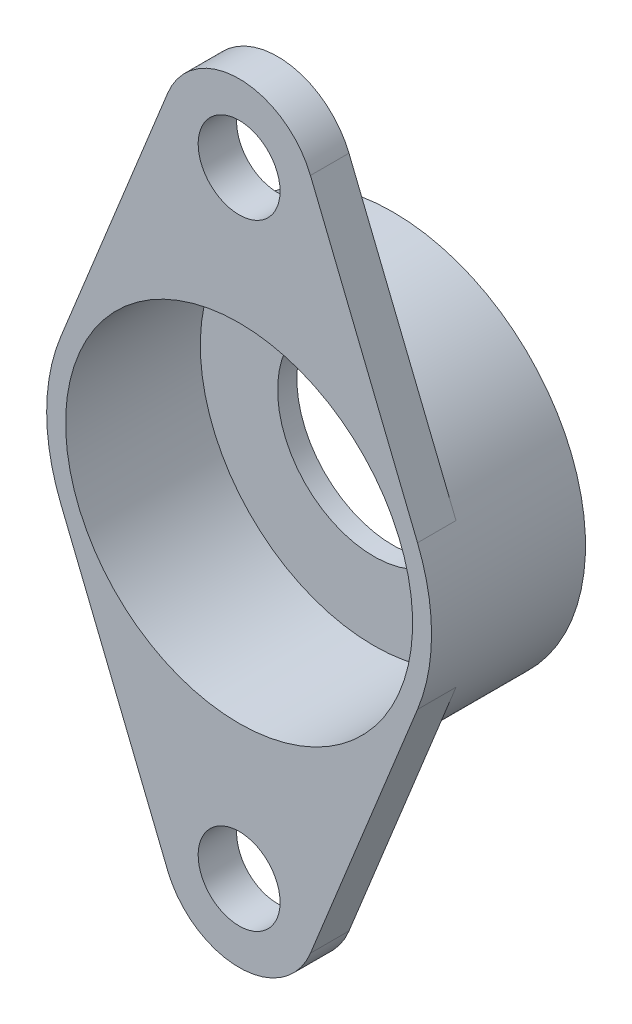
ISO-10303-21;
HEADER;
FILE_DESCRIPTION(('STEP AP214'),'2;1');
FILE_NAME('part.step','',(''),(''),'','','');
FILE_SCHEMA(('AUTOMOTIVE_DESIGN { 1 0 10303 214 1 1 1 1 }'));
ENDSEC;
DATA;
#1=APPLICATION_CONTEXT('core data for automotive mechanical design processes');
#2=APPLICATION_PROTOCOL_DEFINITION('international standard','automotive_design',2000,#1);
#3=PRODUCT_CONTEXT('',#1,'mechanical');
#4=PRODUCT('Part','Part','',(#3));
#5=PRODUCT_RELATED_PRODUCT_CATEGORY('part','',(#4));
#6=PRODUCT_DEFINITION_FORMATION('','',#4);
#7=PRODUCT_DEFINITION_CONTEXT('part definition',#1,'design');
#8=PRODUCT_DEFINITION('design','',#6,#7);
#9=PRODUCT_DEFINITION_SHAPE('','',#8);
#10=(LENGTH_UNIT() NAMED_UNIT(*) SI_UNIT(.MILLI.,.METRE.));
#11=(NAMED_UNIT(*) PLANE_ANGLE_UNIT() SI_UNIT($,.RADIAN.));
#12=(NAMED_UNIT(*) SI_UNIT($,.STERADIAN.) SOLID_ANGLE_UNIT());
#13=UNCERTAINTY_MEASURE_WITH_UNIT(LENGTH_MEASURE(1.E-05),#10,'distance_accuracy_value','');
#14=(GEOMETRIC_REPRESENTATION_CONTEXT(3) GLOBAL_UNCERTAINTY_ASSIGNED_CONTEXT((#13)) GLOBAL_UNIT_ASSIGNED_CONTEXT((#10,
#11,#12)) REPRESENTATION_CONTEXT('',''));
#15=CARTESIAN_POINT('',(0.,0.,0.));
#16=DIRECTION('',(0.,0.,1.));
#17=DIRECTION('',(1.,0.,0.));
#18=AXIS2_PLACEMENT_3D('',#15,#16,#17);
#19=CARTESIAN_POINT('',(0.,-25.4,-72.1221359916635));
#20=DIRECTION('',(0.,0.,1.));
#21=DIRECTION('',(1.,0.,0.));
#22=AXIS2_PLACEMENT_3D('',#19,#20,#21);
#23=CYLINDRICAL_SURFACE('',#22,3.3782);
#24=CARTESIAN_POINT('',(0.,-25.4,-3.175));
#25=DIRECTION('',(0.,0.,1.));
#26=DIRECTION('',(1.,0.,0.));
#27=AXIS2_PLACEMENT_3D('',#24,#25,#26);
#28=CIRCLE('',#27,3.3782);
#29=CARTESIAN_POINT('',(3.3782,-25.4,-3.175));
#30=VERTEX_POINT('',#29);
#31=EDGE_CURVE('E25',#30,#30,#28,.T.);
#32=ORIENTED_EDGE('',*,*,#31,.F.);
#33=EDGE_LOOP('',(#32));
#34=FACE_BOUND('',#33,.T.);
#35=CARTESIAN_POINT('',(0.,-25.4,0.));
#36=DIRECTION('',(0.,0.,-1.));
#37=DIRECTION('',(0.,-1.,0.));
#38=AXIS2_PLACEMENT_3D('',#35,#36,#37);
#39=CIRCLE('',#38,3.3782);
#40=CARTESIAN_POINT('',(0.,-28.7782,0.));
#41=VERTEX_POINT('',#40);
#42=EDGE_CURVE('E92',#41,#41,#39,.T.);
#43=ORIENTED_EDGE('',*,*,#42,.F.);
#44=EDGE_LOOP('',(#43));
#45=FACE_BOUND('',#44,.T.);
#46=ADVANCED_FACE('F15',(#34,#45),#23,.F.);
#47=CARTESIAN_POINT('',(0.,25.4,-72.1221359916635));
#48=DIRECTION('',(0.,0.,1.));
#49=DIRECTION('',(1.,0.,0.));
#50=AXIS2_PLACEMENT_3D('',#47,#48,#49);
#51=CYLINDRICAL_SURFACE('',#50,3.3782);
#52=CARTESIAN_POINT('',(0.,25.4,-3.175));
#53=DIRECTION('',(0.,0.,1.));
#54=DIRECTION('',(1.,0.,0.));
#55=AXIS2_PLACEMENT_3D('',#52,#53,#54);
#56=CIRCLE('',#55,3.3782);
#57=CARTESIAN_POINT('',(3.3782,25.4,-3.175));
#58=VERTEX_POINT('',#57);
#59=EDGE_CURVE('E133',#58,#58,#56,.T.);
#60=ORIENTED_EDGE('',*,*,#59,.F.);
#61=EDGE_LOOP('',(#60));
#62=FACE_BOUND('',#61,.T.);
#63=CARTESIAN_POINT('',(0.,25.4,0.));
#64=DIRECTION('',(0.,0.,-1.));
#65=DIRECTION('',(0.,-1.,0.));
#66=AXIS2_PLACEMENT_3D('',#63,#64,#65);
#67=CIRCLE('',#66,3.3782);
#68=CARTESIAN_POINT('',(0.,22.0218,0.));
#69=VERTEX_POINT('',#68);
#70=EDGE_CURVE('E173',#69,#69,#67,.T.);
#71=ORIENTED_EDGE('',*,*,#70,.F.);
#72=EDGE_LOOP('',(#71));
#73=FACE_BOUND('',#72,.T.);
#74=ADVANCED_FACE('F188',(#62,#73),#51,.F.);
#75=CARTESIAN_POINT('',(0.,0.,0.));
#76=DIRECTION('',(0.,0.,-1.));
#77=DIRECTION('',(0.,-1.,0.));
#78=AXIS2_PLACEMENT_3D('',#75,#76,#77);
#79=CYLINDRICAL_SURFACE('',#78,14.3129);
#80=CARTESIAN_POINT('',(0.,0.,-11.1125));
#81=DIRECTION('',(0.,0.,1.));
#82=DIRECTION('',(1.,0.,0.));
#83=AXIS2_PLACEMENT_3D('',#80,#81,#82);
#84=CIRCLE('',#83,14.3129);
#85=CARTESIAN_POINT('',(14.3129,0.,-11.1125));
#86=VERTEX_POINT('',#85);
#87=EDGE_CURVE('E9',#86,#86,#84,.T.);
#88=ORIENTED_EDGE('',*,*,#87,.F.);
#89=EDGE_LOOP('',(#88));
#90=FACE_BOUND('',#89,.T.);
#91=CARTESIAN_POINT('',(0.,0.,0.));
#92=DIRECTION('',(0.,0.,-1.));
#93=DIRECTION('',(0.,-1.,0.));
#94=AXIS2_PLACEMENT_3D('',#91,#92,#93);
#95=CIRCLE('',#94,14.3129);
#96=CARTESIAN_POINT('',(0.,-14.3129,0.));
#97=VERTEX_POINT('',#96);
#98=EDGE_CURVE('E171',#97,#97,#95,.T.);
#99=ORIENTED_EDGE('',*,*,#98,.F.);
#100=EDGE_LOOP('',(#99));
#101=FACE_BOUND('',#100,.T.);
#102=ADVANCED_FACE('F199',(#90,#101),#79,.F.);
#103=CARTESIAN_POINT('',(0.,0.,-11.1125));
#104=DIRECTION('',(0.,0.,-1.));
#105=DIRECTION('',(-1.,0.,0.));
#106=AXIS2_PLACEMENT_3D('',#103,#104,#105);
#107=PLANE('',#106);
#108=CARTESIAN_POINT('',(0.,0.,-11.1125));
#109=DIRECTION('',(0.,0.,1.));
#110=DIRECTION('',(1.,0.,0.));
#111=AXIS2_PLACEMENT_3D('',#108,#109,#110);
#112=CIRCLE('',#111,7.9375);
#113=CARTESIAN_POINT('',(7.9375,0.,-11.1125));
#114=VERTEX_POINT('',#113);
#115=EDGE_CURVE('E137',#114,#114,#112,.T.);
#116=ORIENTED_EDGE('',*,*,#115,.F.);
#117=EDGE_LOOP('',(#116));
#118=FACE_BOUND('',#117,.T.);
#119=ORIENTED_EDGE('',*,*,#87,.T.);
#120=EDGE_LOOP('',(#119));
#121=FACE_BOUND('',#120,.T.);
#122=ADVANCED_FACE('F201',(#118,#121),#107,.F.);
#123=CARTESIAN_POINT('',(0.,0.,-3.175));
#124=DIRECTION('',(0.,0.,1.));
#125=DIRECTION('',(1.,0.,0.));
#126=AXIS2_PLACEMENT_3D('',#123,#124,#125);
#127=PLANE('',#126);
#128=ORIENTED_EDGE('',*,*,#31,.T.);
#129=EDGE_LOOP('',(#128));
#130=FACE_BOUND('',#129,.T.);
#131=CARTESIAN_POINT('',(0.,0.,-3.175));
#132=DIRECTION('',(0.,0.,-1.));
#133=DIRECTION('',(-1.,0.,0.));
#134=AXIS2_PLACEMENT_3D('',#131,#132,#133);
#135=CIRCLE('',#134,15.875);
#136=CARTESIAN_POINT('',(14.7165188728305,-5.953125,-3.175));
#137=VERTEX_POINT('',#136);
#138=CARTESIAN_POINT('',(-14.7165188728305,-5.953125,-3.175));
#139=VERTEX_POINT('',#138);
#140=EDGE_CURVE('E34',#137,#139,#135,.T.);
#141=ORIENTED_EDGE('',*,*,#140,.F.);
#142=DIRECTION('',(0.375,0.927024810886958,0.));
#143=VECTOR('',#142,1.);
#144=CARTESIAN_POINT('',(10.3015632109813,-16.8671875,-3.175));
#145=LINE('',#144,#143);
#146=CARTESIAN_POINT('',(5.88660754913219,-27.78125,-3.175));
#147=VERTEX_POINT('',#146);
#148=EDGE_CURVE('E108',#147,#137,#145,.T.);
#149=ORIENTED_EDGE('',*,*,#148,.F.);
#150=CARTESIAN_POINT('',(0.,-25.4,-3.175));
#151=DIRECTION('',(0.,0.,1.));
#152=DIRECTION('',(1.,0.,0.));
#153=AXIS2_PLACEMENT_3D('',#150,#151,#152);
#154=CIRCLE('',#153,6.35);
#155=CARTESIAN_POINT('',(-5.88660754913218,-27.78125,-3.175));
#156=VERTEX_POINT('',#155);
#157=EDGE_CURVE('E103',#156,#147,#154,.T.);
#158=ORIENTED_EDGE('',*,*,#157,.F.);
#159=DIRECTION('',(0.375,-0.927024810886958,0.));
#160=VECTOR('',#159,1.);
#161=CARTESIAN_POINT('',(-14.7165188728305,-5.95312499999999,-3.175));
#162=LINE('',#161,#160);
#163=EDGE_CURVE('E89',#139,#156,#162,.T.);
#164=ORIENTED_EDGE('',*,*,#163,.F.);
#165=EDGE_LOOP('',(#141,#149,#158,#164));
#166=FACE_BOUND('',#165,.T.);
#167=ADVANCED_FACE('F184',(#130,#166),#127,.F.);
#168=CARTESIAN_POINT('',(0.,0.,-3.175));
#169=DIRECTION('',(0.,0.,1.));
#170=DIRECTION('',(1.,0.,0.));
#171=AXIS2_PLACEMENT_3D('',#168,#169,#170);
#172=PLANE('',#171);
#173=ORIENTED_EDGE('',*,*,#59,.T.);
#174=EDGE_LOOP('',(#173));
#175=FACE_BOUND('',#174,.T.);
#176=CARTESIAN_POINT('',(0.,0.,-3.175));
#177=DIRECTION('',(0.,0.,-1.));
#178=DIRECTION('',(-1.,0.,0.));
#179=AXIS2_PLACEMENT_3D('',#176,#177,#178);
#180=CIRCLE('',#179,15.875);
#181=CARTESIAN_POINT('',(-14.7165188728305,5.953125,-3.175));
#182=VERTEX_POINT('',#181);
#183=CARTESIAN_POINT('',(14.7165188728305,5.953125,-3.175));
#184=VERTEX_POINT('',#183);
#185=EDGE_CURVE('E112',#182,#184,#180,.T.);
#186=ORIENTED_EDGE('',*,*,#185,.F.);
#187=DIRECTION('',(-0.375,-0.927024810886958,0.));
#188=VECTOR('',#187,1.);
#189=CARTESIAN_POINT('',(-10.3015632109813,16.8671875,-3.175));
#190=LINE('',#189,#188);
#191=CARTESIAN_POINT('',(-5.88660754913219,27.78125,-3.175));
#192=VERTEX_POINT('',#191);
#193=EDGE_CURVE('E116',#192,#182,#190,.T.);
#194=ORIENTED_EDGE('',*,*,#193,.F.);
#195=CARTESIAN_POINT('',(0.,25.4,-3.175));
#196=DIRECTION('',(0.,0.,1.));
#197=DIRECTION('',(1.,0.,0.));
#198=AXIS2_PLACEMENT_3D('',#195,#196,#197);
#199=CIRCLE('',#198,6.35);
#200=CARTESIAN_POINT('',(5.88660754913219,27.78125,-3.175));
#201=VERTEX_POINT('',#200);
#202=EDGE_CURVE('E121',#201,#192,#199,.T.);
#203=ORIENTED_EDGE('',*,*,#202,.F.);
#204=DIRECTION('',(-0.375,0.927024810886958,0.));
#205=VECTOR('',#204,1.);
#206=CARTESIAN_POINT('',(14.7165188728305,5.953125,-3.175));
#207=LINE('',#206,#205);
#208=EDGE_CURVE('E126',#184,#201,#207,.T.);
#209=ORIENTED_EDGE('',*,*,#208,.F.);
#210=EDGE_LOOP('',(#186,#194,#203,#209));
#211=FACE_BOUND('',#210,.T.);
#212=ADVANCED_FACE('F237',(#175,#211),#172,.F.);
#213=CARTESIAN_POINT('',(0.,0.,-12.7));
#214=DIRECTION('',(0.,0.,1.));
#215=DIRECTION('',(1.,0.,0.));
#216=AXIS2_PLACEMENT_3D('',#213,#214,#215);
#217=PLANE('',#216);
#218=CARTESIAN_POINT('',(0.,0.,-12.7));
#219=DIRECTION('',(0.,0.,-1.));
#220=DIRECTION('',(0.,-1.,0.));
#221=AXIS2_PLACEMENT_3D('',#218,#219,#220);
#222=CIRCLE('',#221,15.875);
#223=CARTESIAN_POINT('',(0.,-15.875,-12.7));
#224=VERTEX_POINT('',#223);
#225=EDGE_CURVE('E130',#224,#224,#222,.T.);
#226=ORIENTED_EDGE('',*,*,#225,.T.);
#227=EDGE_LOOP('',(#226));
#228=FACE_BOUND('',#227,.T.);
#229=CARTESIAN_POINT('',(0.,0.,-12.7));
#230=DIRECTION('',(0.,0.,1.));
#231=DIRECTION('',(1.,0.,0.));
#232=AXIS2_PLACEMENT_3D('',#229,#230,#231);
#233=CIRCLE('',#232,7.9375);
#234=CARTESIAN_POINT('',(7.9375,0.,-12.7));
#235=VERTEX_POINT('',#234);
#236=EDGE_CURVE('E134',#235,#235,#233,.T.);
#237=ORIENTED_EDGE('',*,*,#236,.T.);
#238=EDGE_LOOP('',(#237));
#239=FACE_BOUND('',#238,.T.);
#240=ADVANCED_FACE('F219',(#228,#239),#217,.F.);
#241=CARTESIAN_POINT('',(0.,0.,0.));
#242=DIRECTION('',(0.,0.,-1.));
#243=DIRECTION('',(0.,-1.,0.));
#244=AXIS2_PLACEMENT_3D('',#241,#242,#243);
#245=CYLINDRICAL_SURFACE('',#244,7.9375);
#246=ORIENTED_EDGE('',*,*,#115,.T.);
#247=EDGE_LOOP('',(#246));
#248=FACE_BOUND('',#247,.T.);
#249=ORIENTED_EDGE('',*,*,#236,.F.);
#250=EDGE_LOOP('',(#249));
#251=FACE_BOUND('',#250,.T.);
#252=ADVANCED_FACE('F216',(#248,#251),#245,.F.);
#253=CARTESIAN_POINT('',(5.88660754913219,-27.78125,0.));
#254=DIRECTION('',(0.927024810886958,-0.375,0.));
#255=DIRECTION('',(0.375,0.927024810886958,0.));
#256=AXIS2_PLACEMENT_3D('',#253,#254,#255);
#257=PLANE('',#256);
#258=ORIENTED_EDGE('',*,*,#148,.T.);
#259=DIRECTION('',(0.,0.,-1.));
#260=VECTOR('',#259,1.);
#261=CARTESIAN_POINT('',(14.7165188728305,-5.953125,0.));
#262=LINE('',#261,#260);
#263=CARTESIAN_POINT('',(14.7165188728305,-5.953125,0.));
#264=VERTEX_POINT('',#263);
#265=EDGE_CURVE('E111',#264,#137,#262,.T.);
#266=ORIENTED_EDGE('',*,*,#265,.F.);
#267=DIRECTION('',(-0.375,-0.927024810886958,0.));
#268=VECTOR('',#267,1.);
#269=CARTESIAN_POINT('',(14.7165188728305,-5.953125,0.));
#270=LINE('',#269,#268);
#271=CARTESIAN_POINT('',(5.88660754913219,-27.78125,0.));
#272=VERTEX_POINT('',#271);
#273=EDGE_CURVE('E140',#264,#272,#270,.T.);
#274=ORIENTED_EDGE('',*,*,#273,.T.);
#275=DIRECTION('',(0.,0.,-1.));
#276=VECTOR('',#275,1.);
#277=CARTESIAN_POINT('',(5.88660754913219,-27.78125,0.));
#278=LINE('',#277,#276);
#279=EDGE_CURVE('E101',#272,#147,#278,.T.);
#280=ORIENTED_EDGE('',*,*,#279,.T.);
#281=EDGE_LOOP('',(#258,#266,#274,#280));
#282=FACE_BOUND('',#281,.T.);
#283=ADVANCED_FACE('F165',(#282),#257,.T.);
#284=CARTESIAN_POINT('',(14.7165188728305,5.953125,0.));
#285=DIRECTION('',(0.927024810886958,0.375,0.));
#286=DIRECTION('',(-0.375,0.927024810886958,0.));
#287=AXIS2_PLACEMENT_3D('',#284,#285,#286);
#288=PLANE('',#287);
#289=ORIENTED_EDGE('',*,*,#208,.T.);
#290=DIRECTION('',(0.,0.,-1.));
#291=VECTOR('',#290,1.);
#292=CARTESIAN_POINT('',(5.88660754913219,27.78125,0.));
#293=LINE('',#292,#291);
#294=CARTESIAN_POINT('',(5.88660754913219,27.78125,0.));
#295=VERTEX_POINT('',#294);
#296=EDGE_CURVE('E119',#295,#201,#293,.T.);
#297=ORIENTED_EDGE('',*,*,#296,.F.);
#298=DIRECTION('',(0.375,-0.927024810886958,0.));
#299=VECTOR('',#298,1.);
#300=CARTESIAN_POINT('',(5.88660754913219,27.78125,0.));
#301=LINE('',#300,#299);
#302=CARTESIAN_POINT('',(14.7165188728305,5.953125,0.));
#303=VERTEX_POINT('',#302);
#304=EDGE_CURVE('E129',#295,#303,#301,.T.);
#305=ORIENTED_EDGE('',*,*,#304,.T.);
#306=DIRECTION('',(0.,0.,-1.));
#307=VECTOR('',#306,1.);
#308=CARTESIAN_POINT('',(14.7165188728305,5.953125,0.));
#309=LINE('',#308,#307);
#310=EDGE_CURVE('E124',#303,#184,#309,.T.);
#311=ORIENTED_EDGE('',*,*,#310,.T.);
#312=EDGE_LOOP('',(#289,#297,#305,#311));
#313=FACE_BOUND('',#312,.T.);
#314=ADVANCED_FACE('F225',(#313),#288,.T.);
#315=CARTESIAN_POINT('',(0.,25.4,0.));
#316=DIRECTION('',(0.,0.,-1.));
#317=DIRECTION('',(0.,-1.,0.));
#318=AXIS2_PLACEMENT_3D('',#315,#316,#317);
#319=CYLINDRICAL_SURFACE('',#318,6.35);
#320=ORIENTED_EDGE('',*,*,#202,.T.);
#321=DIRECTION('',(0.,0.,-1.));
#322=VECTOR('',#321,1.);
#323=CARTESIAN_POINT('',(-5.88660754913219,27.78125,0.));
#324=LINE('',#323,#322);
#325=CARTESIAN_POINT('',(-5.88660754913219,27.78125,0.));
#326=VERTEX_POINT('',#325);
#327=EDGE_CURVE('E149',#326,#192,#324,.T.);
#328=ORIENTED_EDGE('',*,*,#327,.F.);
#329=CARTESIAN_POINT('',(0.,25.4,0.));
#330=DIRECTION('',(0.,0.,-1.));
#331=DIRECTION('',(0.,-1.,0.));
#332=AXIS2_PLACEMENT_3D('',#329,#330,#331);
#333=CIRCLE('',#332,6.35);
#334=EDGE_CURVE('E125',#326,#295,#333,.T.);
#335=ORIENTED_EDGE('',*,*,#334,.T.);
#336=ORIENTED_EDGE('',*,*,#296,.T.);
#337=EDGE_LOOP('',(#320,#328,#335,#336));
#338=FACE_BOUND('',#337,.T.);
#339=ADVANCED_FACE('F223',(#338),#319,.T.);
#340=CARTESIAN_POINT('',(-5.88660754913219,27.78125,0.));
#341=DIRECTION('',(-0.927024810886958,0.375,0.));
#342=DIRECTION('',(-0.375,-0.927024810886958,0.));
#343=AXIS2_PLACEMENT_3D('',#340,#341,#342);
#344=PLANE('',#343);
#345=ORIENTED_EDGE('',*,*,#193,.T.);
#346=DIRECTION('',(0.,0.,-1.));
#347=VECTOR('',#346,1.);
#348=CARTESIAN_POINT('',(-14.7165188728305,5.953125,0.));
#349=LINE('',#348,#347);
#350=CARTESIAN_POINT('',(-14.7165188728305,5.953125,0.));
#351=VERTEX_POINT('',#350);
#352=EDGE_CURVE('E114',#351,#182,#349,.T.);
#353=ORIENTED_EDGE('',*,*,#352,.F.);
#354=DIRECTION('',(0.375,0.927024810886958,0.));
#355=VECTOR('',#354,1.);
#356=CARTESIAN_POINT('',(-14.7165188728305,5.953125,0.));
#357=LINE('',#356,#355);
#358=EDGE_CURVE('E120',#351,#326,#357,.T.);
#359=ORIENTED_EDGE('',*,*,#358,.T.);
#360=ORIENTED_EDGE('',*,*,#327,.T.);
#361=EDGE_LOOP('',(#345,#353,#359,#360));
#362=FACE_BOUND('',#361,.T.);
#363=ADVANCED_FACE('F221',(#362),#344,.T.);
#364=CARTESIAN_POINT('',(0.,0.,0.));
#365=DIRECTION('',(0.,0.,-1.));
#366=DIRECTION('',(0.,-1.,0.));
#367=AXIS2_PLACEMENT_3D('',#364,#365,#366);
#368=CYLINDRICAL_SURFACE('',#367,15.875);
#369=ORIENTED_EDGE('',*,*,#225,.F.);
#370=EDGE_LOOP('',(#369));
#371=FACE_BOUND('',#370,.T.);
#372=ORIENTED_EDGE('',*,*,#140,.T.);
#373=DIRECTION('',(0.,0.,-1.));
#374=VECTOR('',#373,1.);
#375=CARTESIAN_POINT('',(-14.7165188728305,-5.953125,0.));
#376=LINE('',#375,#374);
#377=CARTESIAN_POINT('',(-14.7165188728305,-5.953125,0.));
#378=VERTEX_POINT('',#377);
#379=EDGE_CURVE('E78',#378,#139,#376,.T.);
#380=ORIENTED_EDGE('',*,*,#379,.F.);
#381=CARTESIAN_POINT('',(0.,0.,0.));
#382=DIRECTION('',(0.,0.,-1.));
#383=DIRECTION('',(0.,-1.,0.));
#384=AXIS2_PLACEMENT_3D('',#381,#382,#383);
#385=CIRCLE('',#384,15.875);
#386=EDGE_CURVE('E99',#378,#351,#385,.T.);
#387=ORIENTED_EDGE('',*,*,#386,.T.);
#388=ORIENTED_EDGE('',*,*,#352,.T.);
#389=ORIENTED_EDGE('',*,*,#185,.T.);
#390=ORIENTED_EDGE('',*,*,#310,.F.);
#391=CARTESIAN_POINT('',(0.,0.,0.));
#392=DIRECTION('',(0.,0.,-1.));
#393=DIRECTION('',(0.,-1.,0.));
#394=AXIS2_PLACEMENT_3D('',#391,#392,#393);
#395=CIRCLE('',#394,15.875);
#396=EDGE_CURVE('E115',#303,#264,#395,.T.);
#397=ORIENTED_EDGE('',*,*,#396,.T.);
#398=ORIENTED_EDGE('',*,*,#265,.T.);
#399=EDGE_LOOP('',(#372,#380,#387,#388,#389,#390,#397,#398));
#400=FACE_BOUND('',#399,.T.);
#401=ADVANCED_FACE('F161',(#371,#400),#368,.T.);
#402=CARTESIAN_POINT('',(-14.7165188728305,-5.953125,0.));
#403=DIRECTION('',(-0.927024810886958,-0.375,0.));
#404=DIRECTION('',(0.375,-0.927024810886958,0.));
#405=AXIS2_PLACEMENT_3D('',#402,#403,#404);
#406=PLANE('',#405);
#407=ORIENTED_EDGE('',*,*,#163,.T.);
#408=DIRECTION('',(0.,0.,-1.));
#409=VECTOR('',#408,1.);
#410=CARTESIAN_POINT('',(-5.88660754913218,-27.78125,0.));
#411=LINE('',#410,#409);
#412=CARTESIAN_POINT('',(-5.88660754913218,-27.78125,0.));
#413=VERTEX_POINT('',#412);
#414=EDGE_CURVE('E85',#413,#156,#411,.T.);
#415=ORIENTED_EDGE('',*,*,#414,.F.);
#416=DIRECTION('',(-0.375,0.927024810886958,0.));
#417=VECTOR('',#416,1.);
#418=CARTESIAN_POINT('',(-5.88660754913218,-27.78125,0.));
#419=LINE('',#418,#417);
#420=EDGE_CURVE('E88',#413,#378,#419,.T.);
#421=ORIENTED_EDGE('',*,*,#420,.T.);
#422=ORIENTED_EDGE('',*,*,#379,.T.);
#423=EDGE_LOOP('',(#407,#415,#421,#422));
#424=FACE_BOUND('',#423,.T.);
#425=ADVANCED_FACE('F87',(#424),#406,.T.);
#426=CARTESIAN_POINT('',(0.,-25.4,0.));
#427=DIRECTION('',(0.,0.,-1.));
#428=DIRECTION('',(0.,-1.,0.));
#429=AXIS2_PLACEMENT_3D('',#426,#427,#428);
#430=CYLINDRICAL_SURFACE('',#429,6.35);
#431=ORIENTED_EDGE('',*,*,#157,.T.);
#432=ORIENTED_EDGE('',*,*,#279,.F.);
#433=CARTESIAN_POINT('',(0.,-25.4,0.));
#434=DIRECTION('',(0.,0.,-1.));
#435=DIRECTION('',(0.,-1.,0.));
#436=AXIS2_PLACEMENT_3D('',#433,#434,#435);
#437=CIRCLE('',#436,6.35);
#438=EDGE_CURVE('E19',#272,#413,#437,.T.);
#439=ORIENTED_EDGE('',*,*,#438,.T.);
#440=ORIENTED_EDGE('',*,*,#414,.T.);
#441=EDGE_LOOP('',(#431,#432,#439,#440));
#442=FACE_BOUND('',#441,.T.);
#443=ADVANCED_FACE('F17',(#442),#430,.T.);
#444=CARTESIAN_POINT('',(0.,0.,0.));
#445=DIRECTION('',(0.,0.,1.));
#446=DIRECTION('',(1.,0.,0.));
#447=AXIS2_PLACEMENT_3D('',#444,#445,#446);
#448=PLANE('',#447);
#449=ORIENTED_EDGE('',*,*,#42,.T.);
#450=EDGE_LOOP('',(#449));
#451=FACE_BOUND('',#450,.T.);
#452=ORIENTED_EDGE('',*,*,#70,.T.);
#453=EDGE_LOOP('',(#452));
#454=FACE_BOUND('',#453,.T.);
#455=ORIENTED_EDGE('',*,*,#98,.T.);
#456=EDGE_LOOP('',(#455));
#457=FACE_BOUND('',#456,.T.);
#458=ORIENTED_EDGE('',*,*,#438,.F.);
#459=ORIENTED_EDGE('',*,*,#273,.F.);
#460=ORIENTED_EDGE('',*,*,#396,.F.);
#461=ORIENTED_EDGE('',*,*,#304,.F.);
#462=ORIENTED_EDGE('',*,*,#334,.F.);
#463=ORIENTED_EDGE('',*,*,#358,.F.);
#464=ORIENTED_EDGE('',*,*,#386,.F.);
#465=ORIENTED_EDGE('',*,*,#420,.F.);
#466=EDGE_LOOP('',(#458,#459,#460,#461,#462,#463,#464,#465));
#467=FACE_BOUND('',#466,.T.);
#468=ADVANCED_FACE('F96',(#451,#454,#457,#467),#448,.T.);
#469=CLOSED_SHELL('',(#46,#74,#102,#122,#167,#212,#240,#252,#283,#314,#339,#363,#401,#425,#443,#468));
#470=MANIFOLD_SOLID_BREP('B1',#469);
#471=ADVANCED_BREP_SHAPE_REPRESENTATION('',(#18,#470),#14);
#472=SHAPE_DEFINITION_REPRESENTATION(#9,#471);
ENDSEC;
END-ISO-10303-21;
